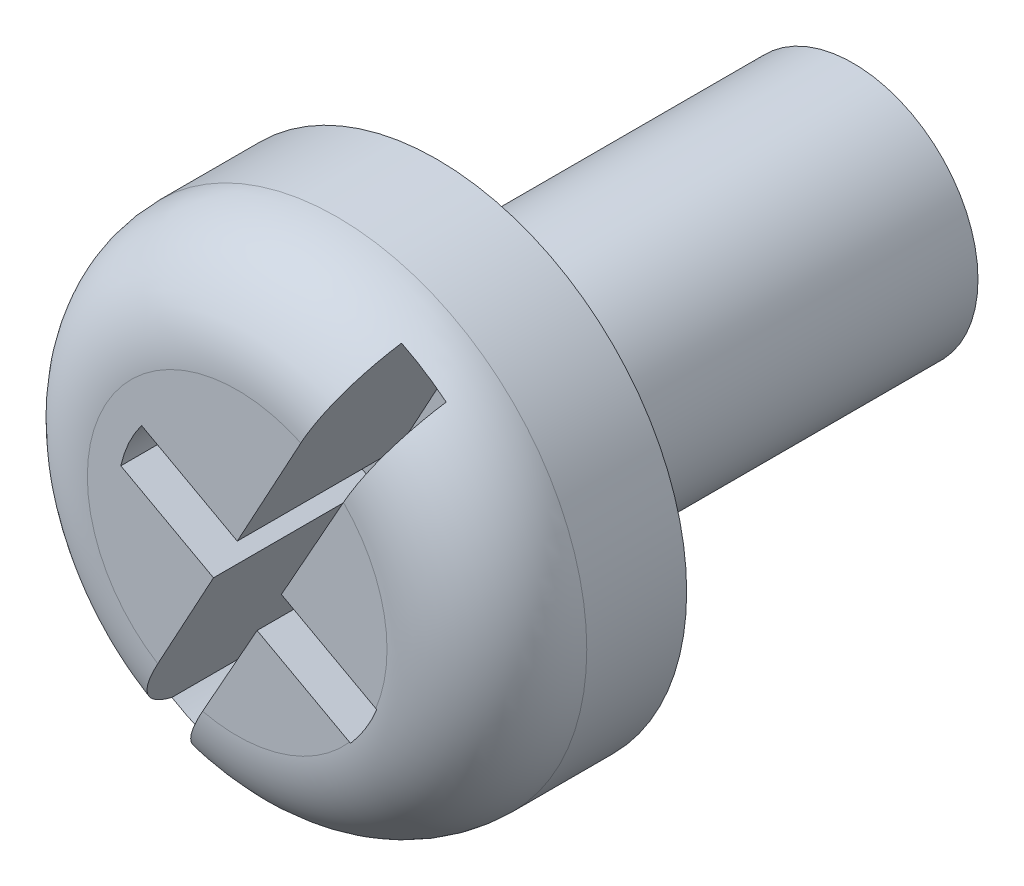
ISO-10303-21;
HEADER;
FILE_DESCRIPTION(('STEP AP214'),'2;1');
FILE_NAME('part.step','',(''),(''),'','','');
FILE_SCHEMA(('AUTOMOTIVE_DESIGN { 1 0 10303 214 1 1 1 1 }'));
ENDSEC;
DATA;
#1=APPLICATION_CONTEXT('core data for automotive mechanical design processes');
#2=APPLICATION_PROTOCOL_DEFINITION('international standard','automotive_design',2000,#1);
#3=PRODUCT_CONTEXT('',#1,'mechanical');
#4=PRODUCT('Part','Part','',(#3));
#5=PRODUCT_RELATED_PRODUCT_CATEGORY('part','',(#4));
#6=PRODUCT_DEFINITION_FORMATION('','',#4);
#7=PRODUCT_DEFINITION_CONTEXT('part definition',#1,'design');
#8=PRODUCT_DEFINITION('design','',#6,#7);
#9=PRODUCT_DEFINITION_SHAPE('','',#8);
#10=(LENGTH_UNIT() NAMED_UNIT(*) SI_UNIT(.MILLI.,.METRE.));
#11=(NAMED_UNIT(*) PLANE_ANGLE_UNIT() SI_UNIT($,.RADIAN.));
#12=(NAMED_UNIT(*) SI_UNIT($,.STERADIAN.) SOLID_ANGLE_UNIT());
#13=UNCERTAINTY_MEASURE_WITH_UNIT(LENGTH_MEASURE(1.E-05),#10,'distance_accuracy_value','');
#14=(GEOMETRIC_REPRESENTATION_CONTEXT(3) GLOBAL_UNCERTAINTY_ASSIGNED_CONTEXT((#13)) GLOBAL_UNIT_ASSIGNED_CONTEXT((#10,
#11,#12)) REPRESENTATION_CONTEXT('',''));
#15=CARTESIAN_POINT('',(0.,0.,0.));
#16=DIRECTION('',(0.,0.,1.));
#17=DIRECTION('',(1.,0.,0.));
#18=AXIS2_PLACEMENT_3D('',#15,#16,#17);
#19=CARTESIAN_POINT('',(-1.86051624597212,2.73214285714287,2.4));
#20=DIRECTION('',(0.,0.,1.));
#21=DIRECTION('',(1.,0.,0.));
#22=AXIS2_PLACEMENT_3D('',#19,#20,#21);
#23=PLANE('',#22);
#24=DIRECTION('',(-0.478292119632489,-0.87820080180871,0.));
#25=VECTOR('',#24,1.);
#26=CARTESIAN_POINT('',(-3.33454353016391,0.250826496084395,2.4));
#27=LINE('',#26,#25);
#28=CARTESIAN_POINT('',(-2.14514294385762,2.43470640062586,2.4));
#29=VERTEX_POINT('',#28);
#30=CARTESIAN_POINT('',(-2.8144800366458,1.20572447213714,2.4));
#31=VERTEX_POINT('',#30);
#32=EDGE_CURVE('E166',#29,#31,#27,.T.);
#33=ORIENTED_EDGE('',*,*,#32,.F.);
#34=DIRECTION('',(0.877616803209732,-0.479362854968896,0.));
#35=VECTOR('',#34,1.);
#36=CARTESIAN_POINT('',(-2.14514294385762,2.43470640062586,2.4));
#37=LINE('',#36,#35);
#38=CARTESIAN_POINT('',(-3.25868789679237,3.04293551135249,2.4));
#39=VERTEX_POINT('',#38);
#40=EDGE_CURVE('E168',#39,#29,#37,.T.);
#41=ORIENTED_EDGE('',*,*,#40,.F.);
#42=CARTESIAN_POINT('',(-1.86051624597212,2.73214285714287,2.4));
#43=DIRECTION('',(0.,0.,1.));
#44=DIRECTION('',(1.,0.,0.));
#45=AXIS2_PLACEMENT_3D('',#42,#43,#44);
#46=CIRCLE('',#45,1.43229746877807);
#47=CARTESIAN_POINT('',(-3.00946383602339,3.58735948138695,2.4));
#48=VERTEX_POINT('',#47);
#49=EDGE_CURVE('E209',#48,#39,#46,.T.);
#50=ORIENTED_EDGE('',*,*,#49,.F.);
#51=DIRECTION('',(-0.87756139574922,0.479464280933086,0.));
#52=VECTOR('',#51,1.);
#53=CARTESIAN_POINT('',(-1.85954831796557,2.95909185285404,2.4));
#54=LINE('',#53,#52);
#55=CARTESIAN_POINT('',(-1.85954831796557,2.95909185285404,2.4));
#56=VERTEX_POINT('',#55);
#57=EDGE_CURVE('E206',#56,#48,#54,.T.);
#58=ORIENTED_EDGE('',*,*,#57,.F.);
#59=DIRECTION('',(-0.478292119632489,-0.87820080180871,0.));
#60=VECTOR('',#59,1.);
#61=CARTESIAN_POINT('',(-1.85954831796557,2.95909185285404,2.4));
#62=LINE('',#61,#60);
#63=CARTESIAN_POINT('',(-1.09571318629089,4.36158333776873,2.4));
#64=VERTEX_POINT('',#63);
#65=EDGE_CURVE('E204',#64,#56,#62,.T.);
#66=ORIENTED_EDGE('',*,*,#65,.F.);
#67=CARTESIAN_POINT('',(-1.86051624597212,2.73214285714287,2.4));
#68=DIRECTION('',(0.,0.,1.));
#69=DIRECTION('',(1.,0.,0.));
#70=AXIS2_PLACEMENT_3D('',#67,#68,#69);
#71=CIRCLE('',#70,1.8);
#72=EDGE_CURVE('E254',#64,#31,#71,.T.);
#73=ORIENTED_EDGE('',*,*,#72,.T.);
#74=EDGE_LOOP('',(#33,#41,#50,#58,#66,#73));
#75=FACE_BOUND('',#74,.T.);
#76=ADVANCED_FACE('F34',(#75),#23,.T.);
#77=DIRECTION('',(0.488945551082672,0.872314305784596,0.));
#78=VECTOR('',#77,1.);
#79=CARTESIAN_POINT('',(-1.32937302466549,2.66942537823253,2.4));
#80=LINE('',#79,#78);
#81=CARTESIAN_POINT('',(-1.32937302466549,2.66942537823253,2.4));
#82=VERTEX_POINT('',#81);
#83=CARTESIAN_POINT('',(-0.583292168991765,4.00048770661469,2.4));
#84=VERTEX_POINT('',#83);
#85=EDGE_CURVE('E202',#82,#84,#80,.T.);
#86=ORIENTED_EDGE('',*,*,#85,.F.);
#87=DIRECTION('',(-0.87756139574922,0.479464280933086,0.));
#88=VECTOR('',#87,1.);
#89=CARTESIAN_POINT('',(-0.183967514701797,2.04362183688296,2.4));
#90=LINE('',#89,#88);
#91=CARTESIAN_POINT('',(-0.194936591049152,2.04961489939557,2.4));
#92=VERTEX_POINT('',#91);
#93=EDGE_CURVE('E200',#92,#82,#90,.T.);
#94=ORIENTED_EDGE('',*,*,#93,.F.);
#95=EDGE_CURVE('E250',#92,#84,#71,.T.);
#96=ORIENTED_EDGE('',*,*,#95,.T.);
#97=EDGE_LOOP('',(#86,#94,#96));
#98=FACE_BOUND('',#97,.T.);
#99=ADVANCED_FACE('F289',(#98),#23,.T.);
#100=CARTESIAN_POINT('',(-1.86051624597212,2.73214285714287,2.4));
#101=DIRECTION('',(0.,0.,-1.));
#102=DIRECTION('',(-1.,0.,0.));
#103=AXIS2_PLACEMENT_3D('',#100,#101,#102);
#104=CYLINDRICAL_SURFACE('',#103,3.);
#105=CARTESIAN_POINT('',(-1.86051624597212,2.73214285714287,1.2));
#106=DIRECTION('',(0.,0.,1.));
#107=DIRECTION('',(1.,0.,0.));
#108=AXIS2_PLACEMENT_3D('',#105,#106,#107);
#109=CIRCLE('',#108,3.);
#110=CARTESIAN_POINT('',(1.13948375402788,2.73214285714287,1.2));
#111=VERTEX_POINT('',#110);
#112=EDGE_CURVE('E255',#111,#111,#109,.F.);
#113=ORIENTED_EDGE('',*,*,#112,.T.);
#114=EDGE_LOOP('',(#113));
#115=FACE_BOUND('',#114,.T.);
#116=CARTESIAN_POINT('',(-1.86051624597212,2.73214285714287,0.));
#117=DIRECTION('',(0.,0.,1.));
#118=DIRECTION('',(1.,0.,0.));
#119=AXIS2_PLACEMENT_3D('',#116,#117,#118);
#120=CIRCLE('',#119,3.);
#121=CARTESIAN_POINT('',(1.13948375402788,2.73214285714287,0.));
#122=VERTEX_POINT('',#121);
#123=EDGE_CURVE('E244',#122,#122,#120,.T.);
#124=ORIENTED_EDGE('',*,*,#123,.T.);
#125=EDGE_LOOP('',(#124));
#126=FACE_BOUND('',#125,.T.);
#127=ADVANCED_FACE('F287',(#115,#126),#104,.T.);
#128=DIRECTION('',(0.877616803209732,-0.479362854968895,0.));
#129=VECTOR('',#128,1.);
#130=CARTESIAN_POINT('',(-0.499159615510704,1.53565425779784,2.4));
#131=LINE('',#130,#129);
#132=CARTESIAN_POINT('',(-1.62131210840641,2.14858489077753,2.4));
#133=VERTEX_POINT('',#132);
#134=CARTESIAN_POINT('',(-0.510336160729363,1.54175899577131,2.4));
#135=VERTEX_POINT('',#134);
#136=EDGE_CURVE('E198',#133,#135,#131,.T.);
#137=ORIENTED_EDGE('',*,*,#136,.F.);
#138=DIRECTION('',(0.488945551082672,0.872314305784596,0.));
#139=VECTOR('',#138,1.);
#140=CARTESIAN_POINT('',(-2.81993360779638,0.0101572502690064,2.4));
#141=LINE('',#140,#139);
#142=CARTESIAN_POINT('',(-2.27591252151725,0.980730303155878,2.4));
#143=VERTEX_POINT('',#142);
#144=EDGE_CURVE('E196',#143,#133,#141,.T.);
#145=ORIENTED_EDGE('',*,*,#144,.F.);
#146=EDGE_CURVE('E253',#143,#135,#71,.T.);
#147=ORIENTED_EDGE('',*,*,#146,.T.);
#148=EDGE_LOOP('',(#137,#145,#147));
#149=FACE_BOUND('',#148,.T.);
#150=ADVANCED_FACE('F284',(#149),#23,.T.);
#151=CARTESIAN_POINT('',(-1.86051624597212,2.73214285714287,0.));
#152=DIRECTION('',(0.,0.,1.));
#153=DIRECTION('',(1.,0.,0.));
#154=AXIS2_PLACEMENT_3D('',#151,#152,#153);
#155=PLANE('',#154);
#156=CARTESIAN_POINT('',(-1.86051624597212,2.73214285714287,0.));
#157=DIRECTION('',(0.,0.,1.));
#158=DIRECTION('',(1.,0.,0.));
#159=AXIS2_PLACEMENT_3D('',#156,#157,#158);
#160=CIRCLE('',#159,1.5);
#161=CARTESIAN_POINT('',(-0.360516245972119,2.73214285714287,0.));
#162=VERTEX_POINT('',#161);
#163=EDGE_CURVE('E247',#162,#162,#160,.F.);
#164=ORIENTED_EDGE('',*,*,#163,.F.);
#165=EDGE_LOOP('',(#164));
#166=FACE_BOUND('',#165,.T.);
#167=ORIENTED_EDGE('',*,*,#123,.F.);
#168=EDGE_LOOP('',(#167));
#169=FACE_BOUND('',#168,.T.);
#170=ADVANCED_FACE('F282',(#166,#169),#155,.F.);
#171=CARTESIAN_POINT('',(-1.86051624597212,2.73214285714287,-5.));
#172=DIRECTION('',(0.,0.,1.));
#173=DIRECTION('',(1.,0.,0.));
#174=AXIS2_PLACEMENT_3D('',#171,#172,#173);
#175=CYLINDRICAL_SURFACE('',#174,1.5);
#176=CARTESIAN_POINT('',(-1.86051624597212,2.73214285714287,-5.));
#177=DIRECTION('',(0.,0.,-1.));
#178=DIRECTION('',(-1.,0.,0.));
#179=AXIS2_PLACEMENT_3D('',#176,#177,#178);
#180=CIRCLE('',#179,1.5);
#181=CARTESIAN_POINT('',(-3.36051624597212,2.73214285714287,-5.));
#182=VERTEX_POINT('',#181);
#183=EDGE_CURVE('E216',#182,#182,#180,.T.);
#184=ORIENTED_EDGE('',*,*,#183,.F.);
#185=EDGE_LOOP('',(#184));
#186=FACE_BOUND('',#185,.T.);
#187=ORIENTED_EDGE('',*,*,#163,.T.);
#188=EDGE_LOOP('',(#187));
#189=FACE_BOUND('',#188,.T.);
#190=ADVANCED_FACE('F278',(#186,#189),#175,.T.);
#191=CARTESIAN_POINT('',(-1.86051624597212,2.73214285714287,-5.));
#192=DIRECTION('',(0.,0.,-1.));
#193=DIRECTION('',(-1.,0.,0.));
#194=AXIS2_PLACEMENT_3D('',#191,#192,#193);
#195=PLANE('',#194);
#196=ORIENTED_EDGE('',*,*,#183,.T.);
#197=EDGE_LOOP('',(#196));
#198=FACE_BOUND('',#197,.T.);
#199=ADVANCED_FACE('F275',(#198),#195,.T.);
#200=CARTESIAN_POINT('',(-1.86051624597212,2.73214285714287,1.2));
#201=DIRECTION('',(0.,0.,1.));
#202=DIRECTION('',(1.,0.,0.));
#203=AXIS2_PLACEMENT_3D('',#200,#201,#202);
#204=TOROIDAL_SURFACE('',#203,1.8,1.2);
#205=CARTESIAN_POINT('',(-0.575540767315494,5.31668131382147,1.70975429270533));
#206=CARTESIAN_POINT('',(-0.5824043740871,5.3040789214284,1.74031456902629));
#207=CARTESIAN_POINT('',(-0.58988200536983,5.29034910753732,1.77025412843296));
#208=CARTESIAN_POINT('',(-0.606016263850412,5.26072470405536,1.82870871238285));
#209=CARTESIAN_POINT('',(-0.614672831189766,5.24483022437174,1.85722380915036));
#210=CARTESIAN_POINT('',(-0.642308509018158,5.19408785703759,1.94027220578123));
#211=CARTESIAN_POINT('',(-0.6629762437161,5.15613945596996,1.99240919048908));
#212=CARTESIAN_POINT('',(-0.708203159379022,5.07309749903989,2.08868631517981));
#213=CARTESIAN_POINT('',(-0.732764089691729,5.02800073116848,2.1328228410772));
#214=CARTESIAN_POINT('',(-0.785077689775711,4.931946784943,2.21185265354796));
#215=CARTESIAN_POINT('',(-0.812829752078776,4.88099072197227,2.24674769517889));
#216=CARTESIAN_POINT('',(-0.870755055483799,4.77463302589651,2.30632883547805));
#217=CARTESIAN_POINT('',(-0.900929651552919,4.71922890491179,2.33100917270618));
#218=CARTESIAN_POINT('',(-0.96283568336023,4.6055621214997,2.3694469225507));
#219=CARTESIAN_POINT('',(-0.994567368093604,4.54729900188777,2.38320258211041));
#220=CARTESIAN_POINT('',(-1.05872386347642,4.42950010164723,2.39941483191493));
#221=CARTESIAN_POINT('',(-1.09114948115231,4.36996283922278,2.40185745763308));
#222=CARTESIAN_POINT('',(-1.15573526747496,4.25137571013191,2.3953503202161));
#223=CARTESIAN_POINT('',(-1.18789545531375,4.19232580822668,2.38640138814567));
#224=CARTESIAN_POINT('',(-1.25111142223883,4.07625382927923,2.35735083248507));
#225=CARTESIAN_POINT('',(-1.28216478936063,4.01923618088856,2.33722626866415));
#226=CARTESIAN_POINT('',(-1.34222441899033,3.90895960987239,2.28639254421336));
#227=CARTESIAN_POINT('',(-1.37123050343914,3.85570101418436,2.25568246428877));
#228=CARTESIAN_POINT('',(-1.42645974489832,3.75429360615512,2.18445449366384));
#229=CARTESIAN_POINT('',(-1.45267457095233,3.7061600904334,2.14390836466459));
#230=CARTESIAN_POINT('',(-1.50148430909094,3.6165396484275,2.05421363754392));
#231=CARTESIAN_POINT('',(-1.52407946375269,3.57505227674305,2.00506561635217));
#232=CARTESIAN_POINT('',(-1.56505668794341,3.49981325510113,1.89942416088343));
#233=CARTESIAN_POINT('',(-1.58342918956016,3.46607917296016,1.84291449103487));
#234=CARTESIAN_POINT('',(-1.61535277583557,3.40746369945995,1.72423224566163));
#235=CARTESIAN_POINT('',(-1.62890390546596,3.38258222552731,1.66205972296445));
#236=CARTESIAN_POINT('',(-1.65068064383632,3.3425975627812,1.53419605152068));
#237=CARTESIAN_POINT('',(-1.65894166858414,3.32742934599587,1.46853155927476));
#238=CARTESIAN_POINT('',(-1.66723338993673,3.31220476661996,1.36857431614967));
#239=CARTESIAN_POINT('',(-1.66931401785529,3.30838448810952,1.33497508943135));
#240=CARTESIAN_POINT('',(-1.67209007621539,3.30328731720154,1.26752282072818));
#241=CARTESIAN_POINT('',(-1.67278531621524,3.30201077447743,1.23366974448996));
#242=CARTESIAN_POINT('',(-1.67278220669648,3.302016483921,1.1998));
#243=B_SPLINE_CURVE_WITH_KNOTS('',3,(#205,#206,#207,#208,#209,#210,#211,#212,#213,#214,#215,
#216,#217,#218,#219,#220,#221,#222,#223,#224,#225,#226,#227,#228,#229,#230,#231,#232,#233,#234,
#235,#236,#237,#238,#239,#240,#241,#242),.UNSPECIFIED.,.F.,.F.,(4,2,2,2,2,2,2,2,2,2,2,2,2,2,2,2,
2,2,4),(0.,0.101223158894359,0.202441180267574,0.404547966509414,0.606745825117994,
0.808905256591363,1.01117855796459,1.21348431109243,1.41603971895592,1.61858035035038,
1.82153828216889,2.02451384422666,2.22807917195367,2.43163085176484,2.63563930015266,
2.83964584558596,3.04227192850753,3.1438024334223,3.24534689421735),.UNSPECIFIED.);
#244=CARTESIAN_POINT('',(-0.575649692772779,5.31648131382147,1.71023901109821));
#245=VERTEX_POINT('',#244);
#246=EDGE_CURVE('E11',#245,#64,#243,.T.);
#247=ORIENTED_EDGE('',*,*,#246,.F.);
#248=CARTESIAN_POINT('',(-1.86051624597212,2.73214285714287,1.71023901109821));
#249=DIRECTION('',(0.,0.,-1.));
#250=DIRECTION('',(-1.,0.,0.));
#251=AXIS2_PLACEMENT_3D('',#248,#249,#250);
#252=CIRCLE('',#251,2.88611976851244);
#253=CARTESIAN_POINT('',(-0.0392710827126332,4.97106075950156,1.71023901109827));
#254=VERTEX_POINT('',#253);
#255=EDGE_CURVE('E47',#254,#245,#252,.F.);
#256=ORIENTED_EDGE('',*,*,#255,.F.);
#257=CARTESIAN_POINT('',(-1.26309170389054,2.78767605909107,1.1998));
#258=CARTESIAN_POINT('',(-1.2631127720155,2.78763847202896,1.22576998040815));
#259=CARTESIAN_POINT('',(-1.26237301012876,2.78895826085872,1.25170198029709));
#260=CARTESIAN_POINT('',(-1.25952072671015,2.79404694123365,1.30315668634531));
#261=CARTESIAN_POINT('',(-1.25741325248622,2.79780682801559,1.32868054522842));
#262=CARTESIAN_POINT('',(-1.24932506804159,2.81223673536059,1.40375196214292));
#263=CARTESIAN_POINT('',(-1.24157094586872,2.8260706513973,1.45250594024511));
#264=CARTESIAN_POINT('',(-1.22556622491573,2.8546242337266,1.53282213605265));
#265=CARTESIAN_POINT('',(-1.21816574900715,2.86782721919272,1.56514626066184));
#266=CARTESIAN_POINT('',(-1.20205095375697,2.89657718204726,1.62840310857575));
#267=CARTESIAN_POINT('',(-1.19333633706057,2.9121246899382,1.65933551490998));
#268=CARTESIAN_POINT('',(-1.16542086668087,2.96192791263038,1.75044821489817));
#269=CARTESIAN_POINT('',(-1.14454383968645,2.99917404212099,1.80849742576797));
#270=CARTESIAN_POINT('',(-1.09772220899005,3.08270722528668,1.92199684801045));
#271=CARTESIAN_POINT('',(-1.07153445687538,3.12942807335531,1.9770243073677));
#272=CARTESIAN_POINT('',(-1.01564250198845,3.22914337236595,2.07869204050147));
#273=CARTESIAN_POINT('',(-0.985948470618887,3.28211967678826,2.12535563158695));
#274=CARTESIAN_POINT('',(-0.918223441287482,3.40294603836298,2.21601487520697));
#275=CARTESIAN_POINT('',(-0.879627663676285,3.47180370334956,2.25827105625763));
#276=CARTESIAN_POINT('',(-0.799196938468586,3.61529794737724,2.32733623557769));
#277=CARTESIAN_POINT('',(-0.75735970921051,3.68993859706798,2.35413423868104));
#278=CARTESIAN_POINT('',(-0.676058999745624,3.83498495607384,2.38861679562639));
#279=CARTESIAN_POINT('',(-0.636757731729013,3.90510126708322,2.39790034547785));
#280=CARTESIAN_POINT('',(-0.558000185780485,4.04561043802723,2.40146077706672));
#281=CARTESIAN_POINT('',(-0.518544054122394,4.11600303699876,2.39574945908726));
#282=CARTESIAN_POINT('',(-0.444261504767299,4.24852848963682,2.3702843287041));
#283=CARTESIAN_POINT('',(-0.409330772893901,4.31084744735557,2.35179428040256));
#284=CARTESIAN_POINT('',(-0.341616033942729,4.43165545014603,2.30246954631037));
#285=CARTESIAN_POINT('',(-0.308831410977736,4.49014559400518,2.27163842037526));
#286=CARTESIAN_POINT('',(-0.248009519737374,4.59865625683126,2.20022273119116));
#287=CARTESIAN_POINT('',(-0.219819428476118,4.64894942308283,2.16018125447389));
#288=CARTESIAN_POINT('',(-0.167249114151315,4.74273867455178,2.0707446602969));
#289=CARTESIAN_POINT('',(-0.142866729021386,4.78623861705231,2.02135488642782));
#290=CARTESIAN_POINT('',(-0.10452820364559,4.85463732540325,1.92879061961627));
#291=CARTESIAN_POINT('',(-0.08951899805589,4.88141483616159,1.88741844310844));
#292=CARTESIAN_POINT('',(-0.0622349441551543,4.93009156608522,1.80110482457957));
#293=CARTESIAN_POINT('',(-0.0499580968395804,4.95199435161951,1.75616602478609));
#294=CARTESIAN_POINT('',(-0.0391589796443221,4.97126075950155,1.70975788936457));
#295=B_SPLINE_CURVE_WITH_KNOTS('',3,(#257,#258,#259,#260,#261,#262,#263,#264,#265,#266,#267,
#268,#269,#270,#271,#272,#273,#274,#275,#276,#277,#278,#279,#280,#281,#282,#283,#284,#285,#286,
#287,#288,#289,#290,#291,#292,#293,#294),.UNSPECIFIED.,.F.,.F.,(4,2,2,2,2,2,2,2,2,2,2,2,2,2,2,2,
2,2,4),(0.,0.0778006917118378,0.155315893483458,0.308266870217621,0.415234357270093,
0.522226084613864,0.737655839714488,0.967269406588131,1.19623253348757,1.46333863997643,
1.73063450143458,1.97205770050909,2.21329096739737,2.43355558113201,2.65375670399323,
2.86332090395877,3.07276567449364,3.22690773757732,3.38093665626108),.UNSPECIFIED.);
#296=EDGE_CURVE('E355',#84,#254,#295,.T.);
#297=ORIENTED_EDGE('',*,*,#296,.F.);
#298=ORIENTED_EDGE('',*,*,#95,.F.);
#299=CARTESIAN_POINT('',(-0.183767514701797,2.04351256492016,2.39993332802436));
#300=CARTESIAN_POINT('',(-0.217782658736837,2.06209707268747,2.40033863472729));
#301=CARTESIAN_POINT('',(-0.251792157132213,2.08067849590415,2.39888813616958));
#302=CARTESIAN_POINT('',(-0.319534364168039,2.11769011553849,2.39230484226138));
#303=CARTESIAN_POINT('',(-0.353267082920302,2.13612031748085,2.38717218204555));
#304=CARTESIAN_POINT('',(-0.453400795391146,2.19082935399903,2.36634775777888));
#305=CARTESIAN_POINT('',(-0.519000364428353,2.22667032233503,2.34523208484704));
#306=CARTESIAN_POINT('',(-0.638425774554932,2.29191956719567,2.2925053228282));
#307=CARTESIAN_POINT('',(-0.69274889876274,2.32159953923238,2.26232665392895));
#308=CARTESIAN_POINT('',(-0.796253299526463,2.37815018437923,2.19212147821412));
#309=CARTESIAN_POINT('',(-0.845435603131863,2.40502141862793,2.1520969438157));
#310=CARTESIAN_POINT('',(-0.93783514695995,2.45550481620521,2.0628344484937));
#311=CARTESIAN_POINT('',(-0.980978593060597,2.47907666139099,2.01349735883978));
#312=CARTESIAN_POINT('',(-1.05943191653211,2.5219404046086,1.90725218211608));
#313=CARTESIAN_POINT('',(-1.09473743753789,2.5412299224976,1.85033991268358));
#314=CARTESIAN_POINT('',(-1.15640863612218,2.57492458708373,1.73042207813507));
#315=CARTESIAN_POINT('',(-1.18276106492887,2.58932249518434,1.66740765860267));
#316=CARTESIAN_POINT('',(-1.22535753184498,2.61259549292461,1.53714360818663));
#317=CARTESIAN_POINT('',(-1.24161903914605,2.62148012702857,1.46990151973345));
#318=CARTESIAN_POINT('',(-1.25768366139594,2.6302571910526,1.36830312947122));
#319=CARTESIAN_POINT('',(-1.26165056048128,2.63242454529892,1.33474662578359));
#320=CARTESIAN_POINT('',(-1.266942961413,2.63531610048746,1.26739967422531));
#321=CARTESIAN_POINT('',(-1.26827119793696,2.6360417955476,1.23360950501902));
#322=CARTESIAN_POINT('',(-1.26826312586215,2.63603738529031,1.1998));
#323=B_SPLINE_CURVE_WITH_KNOTS('',3,(#299,#300,#301,#302,#303,#304,#305,#306,#307,#308,#309,
#310,#311,#312,#313,#314,#315,#316,#317,#318,#319,#320,#321,#322),.UNSPECIFIED.,.F.,.F.,(4,2,2,
2,2,2,2,2,2,2,2,4),(0.,0.116194057201358,0.232383850320403,0.463878668865414,0.66956690126712,
0.875213961759851,1.08318799595766,1.29127733555275,1.49967327769664,1.70770743525587,
1.80916908072369,1.91052551761236),.UNSPECIFIED.);
#324=CARTESIAN_POINT('',(-0.183967514701797,2.04362183688296,2.39993569454367));
#325=VERTEX_POINT('',#324);
#326=EDGE_CURVE('E360',#325,#92,#323,.T.);
#327=ORIENTED_EDGE('',*,*,#326,.F.);
#328=CARTESIAN_POINT('',(-1.86051624597212,2.73214285714287,2.39993569454367));
#329=DIRECTION('',(0.,0.,-1.));
#330=DIRECTION('',(-1.,0.,0.));
#331=AXIS2_PLACEMENT_3D('',#328,#329,#330);
#332=CIRCLE('',#331,1.81242292075108);
#333=CARTESIAN_POINT('',(-0.499159615510704,1.53565425779784,2.39993569454353));
#334=VERTEX_POINT('',#333);
#335=EDGE_CURVE('E313',#334,#325,#332,.F.);
#336=ORIENTED_EDGE('',*,*,#335,.F.);
#337=CARTESIAN_POINT('',(-1.62151210840638,2.14869413272758,1.46884807485071));
#338=CARTESIAN_POINT('',(-1.61337014202699,2.14424691130428,1.50015816020714));
#339=CARTESIAN_POINT('',(-1.60395340171439,2.13910339592918,1.53100343533154));
#340=CARTESIAN_POINT('',(-1.58283284504561,2.12756714194424,1.59162369108894));
#341=CARTESIAN_POINT('',(-1.57113159541627,2.12117580530562,1.62139982889169));
#342=CARTESIAN_POINT('',(-1.53304521941817,2.10037265538062,1.70882633846756));
#343=CARTESIAN_POINT('',(-1.50362091999362,2.08430081613823,1.76478080452301));
#344=CARTESIAN_POINT('',(-1.43685873996878,2.0478346624552,1.87328351003643));
#345=CARTESIAN_POINT('',(-1.39926537871097,2.02730080198841,1.92562519772884));
#346=CARTESIAN_POINT('',(-1.31781577832807,1.98281223609858,2.02368680610002));
#347=CARTESIAN_POINT('',(-1.27395030371921,1.95885248616424,2.06939675818379));
#348=CARTESIAN_POINT('',(-1.17347767984285,1.90397335936148,2.15971584324997));
#349=CARTESIAN_POINT('',(-1.11595236120694,1.87255246943155,2.2030105340935));
#350=CARTESIAN_POINT('',(-0.99525776678779,1.80662790514737,2.27762475239334));
#351=CARTESIAN_POINT('',(-0.93209357834735,1.77212700954936,2.30895494207597));
#352=CARTESIAN_POINT('',(-0.807854099588225,1.70426619487488,2.35608316652604));
#353=CARTESIAN_POINT('',(-0.747121541030133,1.67109347922781,2.37304527651785));
#354=CARTESIAN_POINT('',(-0.654777795629045,1.6206544251075,2.38976872479177));
#355=CARTESIAN_POINT('',(-0.623736747104048,1.6036995017426,2.39388947843407));
#356=CARTESIAN_POINT('',(-0.561450947954723,1.56967839093998,2.39915564694617));
#357=CARTESIAN_POINT('',(-0.530206133741795,1.55261216876954,2.40030008361231));
#358=CARTESIAN_POINT('',(-0.498959615510704,1.53554501584778,2.39993337202856));
#359=B_SPLINE_CURVE_WITH_KNOTS('',3,(#337,#338,#339,#340,#341,#342,#343,#344,#345,#346,#347,
#348,#349,#350,#351,#352,#353,#354,#355,#356,#357,#358),.UNSPECIFIED.,.F.,.F.,(4,2,2,2,2,2,2,2,
2,2,4),(0.,0.0978774872130326,0.195645631969167,0.390542213792294,0.592750808490968,
0.795260275068813,1.02975854366474,1.26404734754404,1.47677448793309,1.58349124104491,
1.69024306351729),.UNSPECIFIED.);
#360=EDGE_CURVE('E312',#135,#334,#359,.T.);
#361=ORIENTED_EDGE('',*,*,#360,.F.);
#362=ORIENTED_EDGE('',*,*,#146,.F.);
#363=CARTESIAN_POINT('',(-2.8200457108647,0.00995725026900685,1.70975788936454));
#364=CARTESIAN_POINT('',(-2.81294284402451,0.022629279584052,1.74025937821588));
#365=CARTESIAN_POINT('',(-2.80520776699475,0.0364292177048946,1.77012651441064));
#366=CARTESIAN_POINT('',(-2.78852805075133,0.0661870405613481,1.82840858711255));
#367=CARTESIAN_POINT('',(-2.77958354431484,0.0821446884128344,1.85682368256077));
#368=CARTESIAN_POINT('',(-2.75105867197416,0.133035128377685,1.93950073195886));
#369=CARTESIAN_POINT('',(-2.72975432624299,0.171043625470118,1.99133402140313));
#370=CARTESIAN_POINT('',(-2.68321245334617,0.254077700442272,2.08695288085192));
#371=CARTESIAN_POINT('',(-2.65797425673365,0.299104472663766,2.13073707832536));
#372=CARTESIAN_POINT('',(-2.60429647966901,0.394869517938271,2.20913797564933));
#373=CARTESIAN_POINT('',(-2.57585694671416,0.445607706252732,2.24375481148769));
#374=CARTESIAN_POINT('',(-2.51624584523596,0.551958232375456,2.30332144687179));
#375=CARTESIAN_POINT('',(-2.48504637325386,0.607620351976805,2.32815425531122));
#376=CARTESIAN_POINT('',(-2.42108372755138,0.721734348430112,2.36706399353599));
#377=CARTESIAN_POINT('',(-2.38832028354668,0.780186707488876,2.38113905697485));
#378=CARTESIAN_POINT('',(-2.3212205298552,0.899897531997037,2.39860255480028));
#379=CARTESIAN_POINT('',(-2.28686565282517,0.961189122932676,2.40169129859643));
#380=CARTESIAN_POINT('',(-2.21836196694208,1.08340466423881,2.39656212253163));
#381=CARTESIAN_POINT('',(-2.18421320380919,1.14432853304119,2.38834178043095));
#382=CARTESIAN_POINT('',(-2.11541314916736,1.26707281769608,2.36052733205186));
#383=CARTESIAN_POINT('',(-2.08081091742779,1.32880570736378,2.34042775974803));
#384=CARTESIAN_POINT('',(-2.01358345624662,1.4487443712908,2.28946888113319));
#385=CARTESIAN_POINT('',(-1.98095779999344,1.5069509070129,2.25861190751046));
#386=CARTESIAN_POINT('',(-1.91595930201837,1.6229129390073,2.1846794657163));
#387=CARTESIAN_POINT('',(-1.88378883195749,1.68030738956684,2.14086134133571));
#388=CARTESIAN_POINT('',(-1.82299040998259,1.78877618152209,2.04373589253331));
#389=CARTESIAN_POINT('',(-1.79437078554514,1.83983566609596,1.99040695083443));
#390=CARTESIAN_POINT('',(-1.74170793806781,1.93379000341657,1.87684814417621));
#391=CARTESIAN_POINT('',(-1.71758927738487,1.97681944238683,1.81676563764669));
#392=CARTESIAN_POINT('',(-1.68499473938053,2.03497046089731,1.72173769517997));
#393=CARTESIAN_POINT('',(-1.67474067883886,2.05326444819932,1.68930008901254));
#394=CARTESIAN_POINT('',(-1.65560220426437,2.0874088741487,1.62278687505944));
#395=CARTESIAN_POINT('',(-1.64671642517575,2.10326174815456,1.58871294486205));
#396=CARTESIAN_POINT('',(-1.6354763758506,2.12331481091859,1.53995134726292));
#397=CARTESIAN_POINT('',(-1.63241040549437,2.12878472427997,1.52594181495768));
#398=CARTESIAN_POINT('',(-1.62657512176459,2.13919529344156,1.49766364899058));
#399=CARTESIAN_POINT('',(-1.62380587038182,2.14413583864574,1.48339496191127));
#400=CARTESIAN_POINT('',(-1.6212000053383,2.14878489077715,1.46899770049256));
#401=B_SPLINE_CURVE_WITH_KNOTS('',3,(#363,#364,#365,#366,#367,#368,#369,#370,#371,#372,#373,
#374,#375,#376,#377,#378,#379,#380,#381,#382,#383,#384,#385,#386,#387,#388,#389,#390,#391,#392,
#393,#394,#395,#396,#397,#398,#399,#400),.UNSPECIFIED.,.F.,.F.,(4,2,2,2,2,2,2,2,2,2,2,2,2,2,2,2,
2,2,4),(0.,0.101288992601227,0.202566874207223,0.404664504390113,0.606796564357891,
0.808925625748703,1.01340315711687,1.21791615496524,1.42796691929092,1.63806268040327,
1.85781625970006,2.07752221615008,2.31370147648449,2.5504245572661,2.78272989816584,
2.89851304910329,3.0141799308455,3.06021461907438,3.10625890623177),.UNSPECIFIED.);
#402=CARTESIAN_POINT('',(-2.81993360779156,0.0101572502776019,1.71023901111888));
#403=VERTEX_POINT('',#402);
#404=EDGE_CURVE('E258',#403,#143,#401,.T.);
#405=ORIENTED_EDGE('',*,*,#404,.F.);
#406=CARTESIAN_POINT('',(-1.86051624597212,2.73214285714287,1.71023901109822));
#407=DIRECTION('',(0.,0.,-1.));
#408=DIRECTION('',(-1.,0.,0.));
#409=AXIS2_PLACEMENT_3D('',#406,#407,#408);
#410=CIRCLE('',#409,2.88611976851244);
#411=CARTESIAN_POINT('',(-3.33454353016391,0.250826496084395,1.71023901109839));
#412=VERTEX_POINT('',#411);
#413=EDGE_CURVE('E149',#412,#403,#410,.F.);
#414=ORIENTED_EDGE('',*,*,#413,.F.);
#415=CARTESIAN_POINT('',(-2.23741101624021,2.26529132598487,1.1998));
#416=CARTESIAN_POINT('',(-2.23740798207602,2.26529689706855,1.23311773914182));
#417=CARTESIAN_POINT('',(-2.23808067093128,2.26406176090843,1.26641957114974));
#418=CARTESIAN_POINT('',(-2.24076710911818,2.25912914321957,1.33278175952951));
#419=CARTESIAN_POINT('',(-2.242780689134,2.25543197257465,1.36584214585618));
#420=CARTESIAN_POINT('',(-2.25080606757614,2.24069643022843,1.46421986667473));
#421=CARTESIAN_POINT('',(-2.25880259100748,2.22601386908886,1.52887702678378));
#422=CARTESIAN_POINT('',(-2.27983915454845,2.18738825471918,1.65459016266913));
#423=CARTESIAN_POINT('',(-2.29288843169437,2.16342824119987,1.71563930558337));
#424=CARTESIAN_POINT('',(-2.32363131516378,2.10698067745266,1.83240079175109));
#425=CARTESIAN_POINT('',(-2.34132519302719,2.07449262864539,1.88811282271796));
#426=CARTESIAN_POINT('',(-2.38115513632148,2.00136015018449,1.99348291171297));
#427=CARTESIAN_POINT('',(-2.40335437218142,1.96059973216481,2.04303659878605));
#428=CARTESIAN_POINT('',(-2.4513978021071,1.87238632251299,2.13371393052453));
#429=CARTESIAN_POINT('',(-2.47724247281079,1.82493245571732,2.17483647109585));
#430=CARTESIAN_POINT('',(-2.53202000366664,1.72435444168758,2.24770555401301));
#431=CARTESIAN_POINT('',(-2.5609706987514,1.67119754741156,2.27939351984365));
#432=CARTESIAN_POINT('',(-2.62100717148868,1.5609634951839,2.3321349510837));
#433=CARTESIAN_POINT('',(-2.65209280048278,1.50388661018668,2.35318915608555));
#434=CARTESIAN_POINT('',(-2.715459985346,1.38753697725104,2.38402091071262));
#435=CARTESIAN_POINT('',(-2.74773931345678,1.32826831973999,2.39381847050695));
#436=CARTESIAN_POINT('',(-2.81262891214323,1.20912335527922,2.40190903095553));
#437=CARTESIAN_POINT('',(-2.84523920539102,1.1492470067008,2.40020123807361));
#438=CARTESIAN_POINT('',(-2.90976172307835,1.03077604629428,2.3853359072085));
#439=CARTESIAN_POINT('',(-2.94167569398232,0.972178227751287,2.37221150496673));
#440=CARTESIAN_POINT('',(-3.00398675295645,0.857767766640874,2.33492525045804));
#441=CARTESIAN_POINT('',(-3.03438411411032,0.801954622659517,2.31076539327067));
#442=CARTESIAN_POINT('',(-3.09273596313708,0.6948137384616,2.2521514303079));
#443=CARTESIAN_POINT('',(-3.12069564895239,0.64347645420905,2.21771995706866));
#444=CARTESIAN_POINT('',(-3.1734523737464,0.546608878697876,2.13952114974382));
#445=CARTESIAN_POINT('',(-3.19824869151269,0.501079911670375,2.09575169275951));
#446=CARTESIAN_POINT('',(-3.2445007498667,0.416155671724698,1.99898020102851));
#447=CARTESIAN_POINT('',(-3.2658668259731,0.376925033380575,1.94578943219456));
#448=CARTESIAN_POINT('',(-3.29438735791881,0.324557969415617,1.86087349664456));
#449=CARTESIAN_POINT('',(-3.30331296750969,0.308169496393382,1.83168275144308));
#450=CARTESIAN_POINT('',(-3.31992520204965,0.277667472433556,1.77179737413023));
#451=CARTESIAN_POINT('',(-3.32761178275446,0.263554002733655,1.74110268836594));
#452=CARTESIAN_POINT('',(-3.3346524556212,0.250626496084396,1.70975429270533));
#453=B_SPLINE_CURVE_WITH_KNOTS('',3,(#415,#416,#417,#418,#419,#420,#421,#422,#423,#424,#425,
#426,#427,#428,#429,#430,#431,#432,#433,#434,#435,#436,#437,#438,#439,#440,#441,#442,#443,#444,
#445,#446,#447,#448,#449,#450,#451,#452),.UNSPECIFIED.,.F.,.F.,(4,2,2,2,2,2,2,2,2,2,2,2,2,2,2,2,
2,2,4),(0.,0.0998914587792622,0.199770306544799,0.39910369637716,0.59880322511113,
0.798514431593275,1.00124780839576,1.20400771705243,1.40800143848499,1.61198096992408,
1.81559733711599,2.01922774808509,2.22226910362057,2.42527376620348,2.62783439007704,
2.83044111327975,3.03769485368784,3.14152109707258,3.24535104714929),.UNSPECIFIED.);
#454=EDGE_CURVE('E62',#31,#412,#453,.T.);
#455=ORIENTED_EDGE('',*,*,#454,.F.);
#456=ORIENTED_EDGE('',*,*,#72,.F.);
#457=EDGE_LOOP('',(#247,#256,#297,#298,#327,#336,#361,#362,#405,#414,#455,#456));
#458=FACE_BOUND('',#457,.T.);
#459=ORIENTED_EDGE('',*,*,#112,.F.);
#460=EDGE_LOOP('',(#459));
#461=FACE_BOUND('',#460,.T.);
#462=ADVANCED_FACE('F36',(#458,#461),#204,.T.);
#463=CARTESIAN_POINT('',(-1.86051624597212,2.73214285714287,0.46));
#464=DIRECTION('',(0.,0.,1.));
#465=DIRECTION('',(1.,0.,0.));
#466=AXIS2_PLACEMENT_3D('',#463,#464,#465);
#467=CYLINDRICAL_SURFACE('',#466,2.88611976851244);
#468=ORIENTED_EDGE('',*,*,#413,.T.);
#469=DIRECTION('',(0.,0.,1.));
#470=VECTOR('',#469,1.);
#471=CARTESIAN_POINT('',(-2.81993360779638,0.0101572502690064,0.46));
#472=LINE('',#471,#470);
#473=CARTESIAN_POINT('',(-2.81993360779638,0.0101572502690064,0.46));
#474=VERTEX_POINT('',#473);
#475=EDGE_CURVE('E54',#474,#403,#472,.T.);
#476=ORIENTED_EDGE('',*,*,#475,.F.);
#477=CARTESIAN_POINT('',(-1.86051624597212,2.73214285714287,0.46));
#478=DIRECTION('',(0.,0.,1.));
#479=DIRECTION('',(1.,0.,0.));
#480=AXIS2_PLACEMENT_3D('',#477,#478,#479);
#481=CIRCLE('',#480,2.88611976851244);
#482=CARTESIAN_POINT('',(-3.33454353016391,0.250826496084395,0.46));
#483=VERTEX_POINT('',#482);
#484=EDGE_CURVE('E146',#483,#474,#481,.T.);
#485=ORIENTED_EDGE('',*,*,#484,.F.);
#486=DIRECTION('',(0.,0.,1.));
#487=VECTOR('',#486,1.);
#488=CARTESIAN_POINT('',(-3.33454353016391,0.250826496084395,0.46));
#489=LINE('',#488,#487);
#490=EDGE_CURVE('E214',#483,#412,#489,.T.);
#491=ORIENTED_EDGE('',*,*,#490,.T.);
#492=EDGE_LOOP('',(#468,#476,#485,#491));
#493=FACE_BOUND('',#492,.T.);
#494=ADVANCED_FACE('F144',(#493),#467,.F.);
#495=CARTESIAN_POINT('',(-3.33454353016391,0.250826496084395,0.46));
#496=DIRECTION('',(-0.87820080180871,0.478292119632489,0.));
#497=DIRECTION('',(-0.478292119632489,-0.87820080180871,0.));
#498=AXIS2_PLACEMENT_3D('',#495,#496,#497);
#499=PLANE('',#498);
#500=ORIENTED_EDGE('',*,*,#454,.T.);
#501=ORIENTED_EDGE('',*,*,#490,.F.);
#502=DIRECTION('',(-0.478292119632489,-0.87820080180871,0.));
#503=VECTOR('',#502,1.);
#504=CARTESIAN_POINT('',(-3.33454353016391,0.250826496084395,0.46));
#505=LINE('',#504,#503);
#506=CARTESIAN_POINT('',(-2.14514294385762,2.43470640062586,0.46));
#507=VERTEX_POINT('',#506);
#508=EDGE_CURVE('E152',#507,#483,#505,.T.);
#509=ORIENTED_EDGE('',*,*,#508,.F.);
#510=DIRECTION('',(0.,0.,1.));
#511=VECTOR('',#510,1.);
#512=CARTESIAN_POINT('',(-2.14514294385762,2.43470640062586,0.46));
#513=LINE('',#512,#511);
#514=EDGE_CURVE('E217',#507,#29,#513,.T.);
#515=ORIENTED_EDGE('',*,*,#514,.T.);
#516=ORIENTED_EDGE('',*,*,#32,.T.);
#517=EDGE_LOOP('',(#500,#501,#509,#515,#516));
#518=FACE_BOUND('',#517,.T.);
#519=ADVANCED_FACE('F274',(#518),#499,.F.);
#520=CARTESIAN_POINT('',(-2.14514294385762,2.43470640062586,0.46));
#521=DIRECTION('',(-0.479362854968896,-0.877616803209732,0.));
#522=DIRECTION('',(0.877616803209732,-0.479362854968896,0.));
#523=AXIS2_PLACEMENT_3D('',#520,#521,#522);
#524=PLANE('',#523);
#525=ORIENTED_EDGE('',*,*,#40,.T.);
#526=ORIENTED_EDGE('',*,*,#514,.F.);
#527=DIRECTION('',(0.877616803209732,-0.479362854968896,0.));
#528=VECTOR('',#527,1.);
#529=CARTESIAN_POINT('',(-2.14514294385762,2.43470640062586,0.46));
#530=LINE('',#529,#528);
#531=CARTESIAN_POINT('',(-3.25868789679237,3.04293551135249,0.46));
#532=VERTEX_POINT('',#531);
#533=EDGE_CURVE('E193',#532,#507,#530,.T.);
#534=ORIENTED_EDGE('',*,*,#533,.F.);
#535=DIRECTION('',(0.,0.,1.));
#536=VECTOR('',#535,1.);
#537=CARTESIAN_POINT('',(-3.25868789679237,3.04293551135249,0.46));
#538=LINE('',#537,#536);
#539=EDGE_CURVE('E219',#532,#39,#538,.T.);
#540=ORIENTED_EDGE('',*,*,#539,.T.);
#541=EDGE_LOOP('',(#525,#526,#534,#540));
#542=FACE_BOUND('',#541,.T.);
#543=ADVANCED_FACE('F327',(#542),#524,.F.);
#544=CARTESIAN_POINT('',(-1.86051624597212,2.73214285714287,0.46));
#545=DIRECTION('',(0.,0.,1.));
#546=DIRECTION('',(1.,0.,0.));
#547=AXIS2_PLACEMENT_3D('',#544,#545,#546);
#548=CYLINDRICAL_SURFACE('',#547,1.43229746877807);
#549=ORIENTED_EDGE('',*,*,#49,.T.);
#550=ORIENTED_EDGE('',*,*,#539,.F.);
#551=CARTESIAN_POINT('',(-1.86051624597212,2.73214285714287,0.46));
#552=DIRECTION('',(0.,0.,1.));
#553=DIRECTION('',(1.,0.,0.));
#554=AXIS2_PLACEMENT_3D('',#551,#552,#553);
#555=CIRCLE('',#554,1.43229746877807);
#556=CARTESIAN_POINT('',(-3.00946383602339,3.58735948138695,0.46));
#557=VERTEX_POINT('',#556);
#558=EDGE_CURVE('E190',#557,#532,#555,.T.);
#559=ORIENTED_EDGE('',*,*,#558,.F.);
#560=DIRECTION('',(0.,0.,1.));
#561=VECTOR('',#560,1.);
#562=CARTESIAN_POINT('',(-3.00946383602339,3.58735948138695,0.46));
#563=LINE('',#562,#561);
#564=EDGE_CURVE('E221',#557,#48,#563,.T.);
#565=ORIENTED_EDGE('',*,*,#564,.T.);
#566=EDGE_LOOP('',(#549,#550,#559,#565));
#567=FACE_BOUND('',#566,.T.);
#568=ADVANCED_FACE('F330',(#567),#548,.F.);
#569=CARTESIAN_POINT('',(-1.85954831796557,2.95909185285404,0.46));
#570=DIRECTION('',(0.479464280933086,0.87756139574922,0.));
#571=DIRECTION('',(-0.87756139574922,0.479464280933086,0.));
#572=AXIS2_PLACEMENT_3D('',#569,#570,#571);
#573=PLANE('',#572);
#574=ORIENTED_EDGE('',*,*,#57,.T.);
#575=ORIENTED_EDGE('',*,*,#564,.F.);
#576=DIRECTION('',(-0.87756139574922,0.479464280933086,0.));
#577=VECTOR('',#576,1.);
#578=CARTESIAN_POINT('',(-1.85954831796557,2.95909185285404,0.46));
#579=LINE('',#578,#577);
#580=CARTESIAN_POINT('',(-1.85954831796557,2.95909185285404,0.46));
#581=VERTEX_POINT('',#580);
#582=EDGE_CURVE('E187',#581,#557,#579,.T.);
#583=ORIENTED_EDGE('',*,*,#582,.F.);
#584=DIRECTION('',(0.,0.,1.));
#585=VECTOR('',#584,1.);
#586=CARTESIAN_POINT('',(-1.85954831796557,2.95909185285404,0.46));
#587=LINE('',#586,#585);
#588=EDGE_CURVE('E223',#581,#56,#587,.T.);
#589=ORIENTED_EDGE('',*,*,#588,.T.);
#590=EDGE_LOOP('',(#574,#575,#583,#589));
#591=FACE_BOUND('',#590,.T.);
#592=ADVANCED_FACE('F334',(#591),#573,.F.);
#593=CARTESIAN_POINT('',(-1.85954831796557,2.95909185285404,0.46));
#594=DIRECTION('',(-0.87820080180871,0.478292119632489,0.));
#595=DIRECTION('',(-0.478292119632489,-0.87820080180871,0.));
#596=AXIS2_PLACEMENT_3D('',#593,#594,#595);
#597=PLANE('',#596);
#598=ORIENTED_EDGE('',*,*,#246,.T.);
#599=ORIENTED_EDGE('',*,*,#65,.T.);
#600=ORIENTED_EDGE('',*,*,#588,.F.);
#601=DIRECTION('',(-0.478292119632489,-0.87820080180871,0.));
#602=VECTOR('',#601,1.);
#603=CARTESIAN_POINT('',(-1.85954831796557,2.95909185285404,0.46));
#604=LINE('',#603,#602);
#605=CARTESIAN_POINT('',(-0.575649692772779,5.31648131382147,0.46));
#606=VERTEX_POINT('',#605);
#607=EDGE_CURVE('E184',#606,#581,#604,.T.);
#608=ORIENTED_EDGE('',*,*,#607,.F.);
#609=DIRECTION('',(0.,0.,1.));
#610=VECTOR('',#609,1.);
#611=CARTESIAN_POINT('',(-0.575649692772779,5.31648131382147,0.46));
#612=LINE('',#611,#610);
#613=EDGE_CURVE('E226',#606,#245,#612,.T.);
#614=ORIENTED_EDGE('',*,*,#613,.T.);
#615=EDGE_LOOP('',(#598,#599,#600,#608,#614));
#616=FACE_BOUND('',#615,.T.);
#617=ADVANCED_FACE('F337',(#616),#597,.F.);
#618=CARTESIAN_POINT('',(-1.86051624597212,2.73214285714287,0.46));
#619=DIRECTION('',(0.,0.,1.));
#620=DIRECTION('',(1.,0.,0.));
#621=AXIS2_PLACEMENT_3D('',#618,#619,#620);
#622=CYLINDRICAL_SURFACE('',#621,2.88611976851244);
#623=ORIENTED_EDGE('',*,*,#255,.T.);
#624=ORIENTED_EDGE('',*,*,#613,.F.);
#625=CARTESIAN_POINT('',(-1.86051624597212,2.73214285714287,0.46));
#626=DIRECTION('',(0.,0.,1.));
#627=DIRECTION('',(1.,0.,0.));
#628=AXIS2_PLACEMENT_3D('',#625,#626,#627);
#629=CIRCLE('',#628,2.88611976851244);
#630=CARTESIAN_POINT('',(-0.0392710827126332,4.97106075950156,0.46));
#631=VERTEX_POINT('',#630);
#632=EDGE_CURVE('E181',#631,#606,#629,.T.);
#633=ORIENTED_EDGE('',*,*,#632,.F.);
#634=DIRECTION('',(0.,0.,1.));
#635=VECTOR('',#634,1.);
#636=CARTESIAN_POINT('',(-0.0392710827126332,4.97106075950156,0.46));
#637=LINE('',#636,#635);
#638=EDGE_CURVE('E229',#631,#254,#637,.T.);
#639=ORIENTED_EDGE('',*,*,#638,.T.);
#640=EDGE_LOOP('',(#623,#624,#633,#639));
#641=FACE_BOUND('',#640,.T.);
#642=ADVANCED_FACE('F342',(#641),#622,.F.);
#643=CARTESIAN_POINT('',(-1.32937302466549,2.66942537823253,0.46));
#644=DIRECTION('',(0.872314305784596,-0.488945551082672,0.));
#645=DIRECTION('',(0.488945551082672,0.872314305784597,0.));
#646=AXIS2_PLACEMENT_3D('',#643,#644,#645);
#647=PLANE('',#646);
#648=ORIENTED_EDGE('',*,*,#296,.T.);
#649=ORIENTED_EDGE('',*,*,#638,.F.);
#650=DIRECTION('',(0.488945551082672,0.872314305784596,0.));
#651=VECTOR('',#650,1.);
#652=CARTESIAN_POINT('',(-1.32937302466549,2.66942537823253,0.46));
#653=LINE('',#652,#651);
#654=CARTESIAN_POINT('',(-1.32937302466549,2.66942537823253,0.46));
#655=VERTEX_POINT('',#654);
#656=EDGE_CURVE('E178',#655,#631,#653,.T.);
#657=ORIENTED_EDGE('',*,*,#656,.F.);
#658=DIRECTION('',(0.,0.,1.));
#659=VECTOR('',#658,1.);
#660=CARTESIAN_POINT('',(-1.32937302466549,2.66942537823253,0.46));
#661=LINE('',#660,#659);
#662=EDGE_CURVE('E232',#655,#82,#661,.T.);
#663=ORIENTED_EDGE('',*,*,#662,.T.);
#664=ORIENTED_EDGE('',*,*,#85,.T.);
#665=EDGE_LOOP('',(#648,#649,#657,#663,#664));
#666=FACE_BOUND('',#665,.T.);
#667=ADVANCED_FACE('F346',(#666),#647,.F.);
#668=CARTESIAN_POINT('',(-0.183967514701797,2.04362183688296,0.46));
#669=DIRECTION('',(0.479464280933086,0.87756139574922,0.));
#670=DIRECTION('',(-0.87756139574922,0.479464280933086,0.));
#671=AXIS2_PLACEMENT_3D('',#668,#669,#670);
#672=PLANE('',#671);
#673=ORIENTED_EDGE('',*,*,#326,.T.);
#674=ORIENTED_EDGE('',*,*,#93,.T.);
#675=ORIENTED_EDGE('',*,*,#662,.F.);
#676=DIRECTION('',(-0.87756139574922,0.479464280933086,0.));
#677=VECTOR('',#676,1.);
#678=CARTESIAN_POINT('',(-0.183967514701797,2.04362183688296,0.46));
#679=LINE('',#678,#677);
#680=CARTESIAN_POINT('',(-0.183967514701797,2.04362183688296,0.46));
#681=VERTEX_POINT('',#680);
#682=EDGE_CURVE('E175',#681,#655,#679,.T.);
#683=ORIENTED_EDGE('',*,*,#682,.F.);
#684=DIRECTION('',(0.,0.,1.));
#685=VECTOR('',#684,1.);
#686=CARTESIAN_POINT('',(-0.183967514701797,2.04362183688296,0.46));
#687=LINE('',#686,#685);
#688=EDGE_CURVE('E235',#681,#325,#687,.T.);
#689=ORIENTED_EDGE('',*,*,#688,.T.);
#690=EDGE_LOOP('',(#673,#674,#675,#683,#689));
#691=FACE_BOUND('',#690,.T.);
#692=ADVANCED_FACE('F351',(#691),#672,.F.);
#693=CARTESIAN_POINT('',(-1.86051624597212,2.73214285714287,0.46));
#694=DIRECTION('',(0.,0.,1.));
#695=DIRECTION('',(1.,0.,0.));
#696=AXIS2_PLACEMENT_3D('',#693,#694,#695);
#697=CYLINDRICAL_SURFACE('',#696,1.81242292075108);
#698=ORIENTED_EDGE('',*,*,#335,.T.);
#699=ORIENTED_EDGE('',*,*,#688,.F.);
#700=CARTESIAN_POINT('',(-1.86051624597212,2.73214285714287,0.46));
#701=DIRECTION('',(0.,0.,1.));
#702=DIRECTION('',(1.,0.,0.));
#703=AXIS2_PLACEMENT_3D('',#700,#701,#702);
#704=CIRCLE('',#703,1.81242292075108);
#705=CARTESIAN_POINT('',(-0.499159615510704,1.53565425779784,0.46));
#706=VERTEX_POINT('',#705);
#707=EDGE_CURVE('E172',#706,#681,#704,.T.);
#708=ORIENTED_EDGE('',*,*,#707,.F.);
#709=DIRECTION('',(0.,0.,1.));
#710=VECTOR('',#709,1.);
#711=CARTESIAN_POINT('',(-0.499159615510704,1.53565425779784,0.46));
#712=LINE('',#711,#710);
#713=EDGE_CURVE('E238',#706,#334,#712,.T.);
#714=ORIENTED_EDGE('',*,*,#713,.T.);
#715=EDGE_LOOP('',(#698,#699,#708,#714));
#716=FACE_BOUND('',#715,.T.);
#717=ADVANCED_FACE('F378',(#716),#697,.F.);
#718=CARTESIAN_POINT('',(-0.499159615510704,1.53565425779784,0.46));
#719=DIRECTION('',(-0.479362854968895,-0.877616803209732,0.));
#720=DIRECTION('',(0.877616803209732,-0.479362854968895,0.));
#721=AXIS2_PLACEMENT_3D('',#718,#719,#720);
#722=PLANE('',#721);
#723=ORIENTED_EDGE('',*,*,#360,.T.);
#724=ORIENTED_EDGE('',*,*,#713,.F.);
#725=DIRECTION('',(0.877616803209732,-0.479362854968895,0.));
#726=VECTOR('',#725,1.);
#727=CARTESIAN_POINT('',(-0.499159615510704,1.53565425779784,0.46));
#728=LINE('',#727,#726);
#729=CARTESIAN_POINT('',(-1.62131210840641,2.14858489077753,0.46));
#730=VERTEX_POINT('',#729);
#731=EDGE_CURVE('E161',#730,#706,#728,.T.);
#732=ORIENTED_EDGE('',*,*,#731,.F.);
#733=DIRECTION('',(0.,0.,1.));
#734=VECTOR('',#733,1.);
#735=CARTESIAN_POINT('',(-1.62131210840641,2.14858489077753,0.46));
#736=LINE('',#735,#734);
#737=EDGE_CURVE('E151',#730,#133,#736,.T.);
#738=ORIENTED_EDGE('',*,*,#737,.T.);
#739=ORIENTED_EDGE('',*,*,#136,.T.);
#740=EDGE_LOOP('',(#723,#724,#732,#738,#739));
#741=FACE_BOUND('',#740,.T.);
#742=ADVANCED_FACE('F269',(#741),#722,.F.);
#743=CARTESIAN_POINT('',(-2.81993360779638,0.0101572502690064,0.46));
#744=DIRECTION('',(0.872314305784596,-0.488945551082672,0.));
#745=DIRECTION('',(0.488945551082672,0.872314305784596,0.));
#746=AXIS2_PLACEMENT_3D('',#743,#744,#745);
#747=PLANE('',#746);
#748=ORIENTED_EDGE('',*,*,#404,.T.);
#749=ORIENTED_EDGE('',*,*,#144,.T.);
#750=ORIENTED_EDGE('',*,*,#737,.F.);
#751=DIRECTION('',(0.488945551082672,0.872314305784596,0.));
#752=VECTOR('',#751,1.);
#753=CARTESIAN_POINT('',(-2.81993360779638,0.0101572502690064,0.46));
#754=LINE('',#753,#752);
#755=EDGE_CURVE('E155',#474,#730,#754,.T.);
#756=ORIENTED_EDGE('',*,*,#755,.F.);
#757=ORIENTED_EDGE('',*,*,#475,.T.);
#758=EDGE_LOOP('',(#748,#749,#750,#756,#757));
#759=FACE_BOUND('',#758,.T.);
#760=ADVANCED_FACE('F156',(#759),#747,.F.);
#761=CARTESIAN_POINT('',(-1.86051624597212,2.73214285714287,0.46));
#762=DIRECTION('',(0.,0.,1.));
#763=DIRECTION('',(1.,0.,0.));
#764=AXIS2_PLACEMENT_3D('',#761,#762,#763);
#765=PLANE('',#764);
#766=ORIENTED_EDGE('',*,*,#484,.T.);
#767=ORIENTED_EDGE('',*,*,#755,.T.);
#768=ORIENTED_EDGE('',*,*,#731,.T.);
#769=ORIENTED_EDGE('',*,*,#707,.T.);
#770=ORIENTED_EDGE('',*,*,#682,.T.);
#771=ORIENTED_EDGE('',*,*,#656,.T.);
#772=ORIENTED_EDGE('',*,*,#632,.T.);
#773=ORIENTED_EDGE('',*,*,#607,.T.);
#774=ORIENTED_EDGE('',*,*,#582,.T.);
#775=ORIENTED_EDGE('',*,*,#558,.T.);
#776=ORIENTED_EDGE('',*,*,#533,.T.);
#777=ORIENTED_EDGE('',*,*,#508,.T.);
#778=EDGE_LOOP('',(#766,#767,#768,#769,#770,#771,#772,#773,#774,#775,#776,#777));
#779=FACE_BOUND('',#778,.T.);
#780=ADVANCED_FACE('F163',(#779),#765,.T.);
#781=CLOSED_SHELL('',(#76,#99,#127,#150,#170,#190,#199,#462,#494,#519,#543,#568,#592,#617,#642,
#667,#692,#717,#742,#760,#780));
#782=MANIFOLD_SOLID_BREP('B2',#781);
#783=ADVANCED_BREP_SHAPE_REPRESENTATION('',(#18,#782),#14);
#784=SHAPE_DEFINITION_REPRESENTATION(#9,#783);
ENDSEC;
END-ISO-10303-21;
